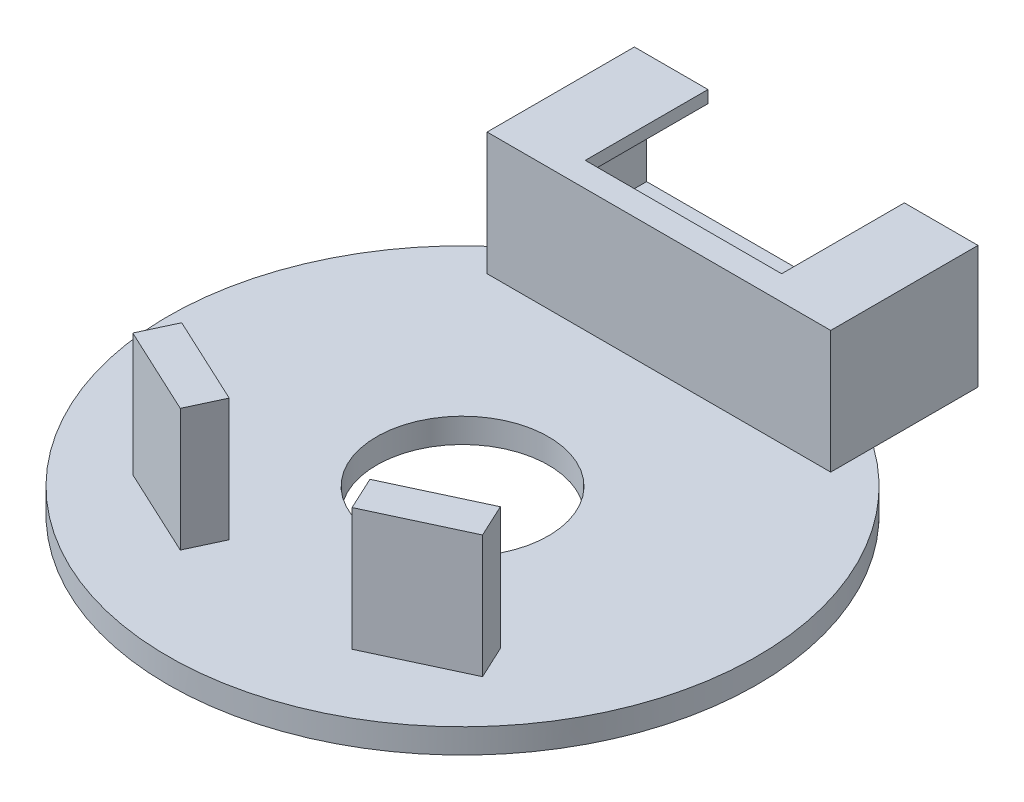
ISO-10303-21;
HEADER;
FILE_DESCRIPTION(('STEP AP214'),'2;1');
FILE_NAME('part.step','',(''),(''),'','','');
FILE_SCHEMA(('AUTOMOTIVE_DESIGN { 1 0 10303 214 1 1 1 1 }'));
ENDSEC;
DATA;
#1=APPLICATION_CONTEXT('core data for automotive mechanical design processes');
#2=APPLICATION_PROTOCOL_DEFINITION('international standard','automotive_design',2000,#1);
#3=PRODUCT_CONTEXT('',#1,'mechanical');
#4=PRODUCT('Part','Part','',(#3));
#5=PRODUCT_RELATED_PRODUCT_CATEGORY('part','',(#4));
#6=PRODUCT_DEFINITION_FORMATION('','',#4);
#7=PRODUCT_DEFINITION_CONTEXT('part definition',#1,'design');
#8=PRODUCT_DEFINITION('design','',#6,#7);
#9=PRODUCT_DEFINITION_SHAPE('','',#8);
#10=(LENGTH_UNIT() NAMED_UNIT(*) SI_UNIT(.MILLI.,.METRE.));
#11=(NAMED_UNIT(*) PLANE_ANGLE_UNIT() SI_UNIT($,.RADIAN.));
#12=(NAMED_UNIT(*) SI_UNIT($,.STERADIAN.) SOLID_ANGLE_UNIT());
#13=UNCERTAINTY_MEASURE_WITH_UNIT(LENGTH_MEASURE(1.E-05),#10,'distance_accuracy_value','');
#14=(GEOMETRIC_REPRESENTATION_CONTEXT(3) GLOBAL_UNCERTAINTY_ASSIGNED_CONTEXT((#13)) GLOBAL_UNIT_ASSIGNED_CONTEXT((#10,
#11,#12)) REPRESENTATION_CONTEXT('',''));
#15=CARTESIAN_POINT('',(0.,0.,0.));
#16=DIRECTION('',(0.,0.,1.));
#17=DIRECTION('',(1.,0.,0.));
#18=AXIS2_PLACEMENT_3D('',#15,#16,#17);
#19=CARTESIAN_POINT('',(0.,0.5,0.));
#20=DIRECTION('',(0.,1.,0.));
#21=DIRECTION('',(0.,0.,1.));
#22=AXIS2_PLACEMENT_3D('',#19,#20,#21);
#23=PLANE('',#22);
#24=DIRECTION('',(0.,0.,1.));
#25=VECTOR('',#24,1.);
#26=CARTESIAN_POINT('',(-7.,0.5,-14.));
#27=LINE('',#26,#25);
#28=CARTESIAN_POINT('',(-7.,0.5,-9.74679434480897));
#29=VERTEX_POINT('',#28);
#30=CARTESIAN_POINT('',(-7.,0.5,-8.));
#31=VERTEX_POINT('',#30);
#32=EDGE_CURVE('E12',#29,#31,#27,.T.);
#33=ORIENTED_EDGE('',*,*,#32,.F.);
#34=CARTESIAN_POINT('',(0.,0.5,0.));
#35=DIRECTION('',(0.,1.,0.));
#36=DIRECTION('',(0.,0.,1.));
#37=AXIS2_PLACEMENT_3D('',#34,#35,#36);
#38=CIRCLE('',#37,12.);
#39=CARTESIAN_POINT('',(7.,0.5,-9.74679434480897));
#40=VERTEX_POINT('',#39);
#41=EDGE_CURVE('E340',#29,#40,#38,.T.);
#42=ORIENTED_EDGE('',*,*,#41,.T.);
#43=DIRECTION('',(0.,0.,-1.));
#44=VECTOR('',#43,1.);
#45=CARTESIAN_POINT('',(7.,0.5,-14.));
#46=LINE('',#45,#44);
#47=CARTESIAN_POINT('',(7.,0.5,-8.));
#48=VERTEX_POINT('',#47);
#49=EDGE_CURVE('E319',#48,#40,#46,.T.);
#50=ORIENTED_EDGE('',*,*,#49,.F.);
#51=DIRECTION('',(1.,0.,0.));
#52=VECTOR('',#51,1.);
#53=CARTESIAN_POINT('',(-7.,0.5,-8.));
#54=LINE('',#53,#52);
#55=EDGE_CURVE('E315',#31,#48,#54,.T.);
#56=ORIENTED_EDGE('',*,*,#55,.F.);
#57=EDGE_LOOP('',(#33,#42,#50,#56));
#58=FACE_BOUND('',#57,.T.);
#59=CARTESIAN_POINT('',(0.,0.5,0.));
#60=DIRECTION('',(0.,1.,0.));
#61=DIRECTION('',(0.,0.,1.));
#62=AXIS2_PLACEMENT_3D('',#59,#60,#61);
#63=CIRCLE('',#62,3.5);
#64=CARTESIAN_POINT('',(0.,0.5,3.5));
#65=VERTEX_POINT('',#64);
#66=EDGE_CURVE('E335',#65,#65,#63,.T.);
#67=ORIENTED_EDGE('',*,*,#66,.F.);
#68=EDGE_LOOP('',(#67));
#69=FACE_BOUND('',#68,.T.);
#70=DIRECTION('',(0.906307787036653,0.,0.422618261740693));
#71=VECTOR('',#70,1.);
#72=CARTESIAN_POINT('',(-3.5,0.5,8.));
#73=LINE('',#72,#71);
#74=CARTESIAN_POINT('',(-7.12523114814661,0.5,6.30952695303723));
#75=VERTEX_POINT('',#74);
#76=CARTESIAN_POINT('',(-3.5,0.5,8.));
#77=VERTEX_POINT('',#76);
#78=EDGE_CURVE('E226',#75,#77,#73,.T.);
#79=ORIENTED_EDGE('',*,*,#78,.F.);
#80=DIRECTION('',(-0.422618261740693,0.,0.906307787036653));
#81=VECTOR('',#80,1.);
#82=CARTESIAN_POINT('',(-7.12523114814661,0.5,6.30952695303723));
#83=LINE('',#82,#81);
#84=CARTESIAN_POINT('',(-6.49130375553557,0.5,4.95006527248225));
#85=VERTEX_POINT('',#84);
#86=EDGE_CURVE('E205',#85,#75,#83,.T.);
#87=ORIENTED_EDGE('',*,*,#86,.F.);
#88=DIRECTION('',(-0.906307787036653,0.,-0.422618261740693));
#89=VECTOR('',#88,1.);
#90=CARTESIAN_POINT('',(-6.49130375553557,0.5,4.95006527248225));
#91=LINE('',#90,#89);
#92=CARTESIAN_POINT('',(-2.86607260738896,0.5,6.64053831944502));
#93=VERTEX_POINT('',#92);
#94=EDGE_CURVE('E219',#93,#85,#91,.T.);
#95=ORIENTED_EDGE('',*,*,#94,.F.);
#96=DIRECTION('',(0.422618261740693,0.,-0.906307787036653));
#97=VECTOR('',#96,1.);
#98=CARTESIAN_POINT('',(-2.86607260738896,0.5,6.64053831944502));
#99=LINE('',#98,#97);
#100=EDGE_CURVE('E63',#77,#93,#99,.T.);
#101=ORIENTED_EDGE('',*,*,#100,.F.);
#102=EDGE_LOOP('',(#79,#87,#95,#101));
#103=FACE_BOUND('',#102,.T.);
#104=DIRECTION('',(-0.422618261740693,0.,-0.906307787036653));
#105=VECTOR('',#104,1.);
#106=CARTESIAN_POINT('',(7.12523114814661,0.5,6.30952695303723));
#107=LINE('',#106,#105);
#108=CARTESIAN_POINT('',(7.12523114814661,0.5,6.30952695303723));
#109=VERTEX_POINT('',#108);
#110=CARTESIAN_POINT('',(6.49130375553557,0.5,4.95006527248225));
#111=VERTEX_POINT('',#110);
#112=EDGE_CURVE('E215',#109,#111,#107,.T.);
#113=ORIENTED_EDGE('',*,*,#112,.F.);
#114=DIRECTION('',(0.906307787036653,0.,-0.422618261740693));
#115=VECTOR('',#114,1.);
#116=CARTESIAN_POINT('',(3.5,0.5,8.));
#117=LINE('',#116,#115);
#118=CARTESIAN_POINT('',(3.5,0.5,8.));
#119=VERTEX_POINT('',#118);
#120=EDGE_CURVE('E209',#119,#109,#117,.T.);
#121=ORIENTED_EDGE('',*,*,#120,.F.);
#122=DIRECTION('',(0.422618261740693,0.,0.906307787036653));
#123=VECTOR('',#122,1.);
#124=CARTESIAN_POINT('',(2.86607260738896,0.5,6.64053831944502));
#125=LINE('',#124,#123);
#126=CARTESIAN_POINT('',(2.86607260738896,0.5,6.64053831944502));
#127=VERTEX_POINT('',#126);
#128=EDGE_CURVE('E189',#127,#119,#125,.T.);
#129=ORIENTED_EDGE('',*,*,#128,.F.);
#130=DIRECTION('',(-0.906307787036653,0.,0.422618261740693));
#131=VECTOR('',#130,1.);
#132=CARTESIAN_POINT('',(6.49130375553557,0.5,4.95006527248225));
#133=LINE('',#132,#131);
#134=EDGE_CURVE('E55',#111,#127,#133,.T.);
#135=ORIENTED_EDGE('',*,*,#134,.F.);
#136=EDGE_LOOP('',(#113,#121,#129,#135));
#137=FACE_BOUND('',#136,.T.);
#138=ADVANCED_FACE('F37',(#58,#69,#103,#137),#23,.T.);
#139=CARTESIAN_POINT('',(6.5,5.,5.60147050873545));
#140=DIRECTION('',(0.,1.,0.));
#141=DIRECTION('',(0.,0.,1.));
#142=AXIS2_PLACEMENT_3D('',#139,#140,#141);
#143=PLANE('',#142);
#144=DIRECTION('',(-1.,0.,0.));
#145=VECTOR('',#144,1.);
#146=CARTESIAN_POINT('',(6.5,5.,-9.));
#147=LINE('',#146,#145);
#148=CARTESIAN_POINT('',(6.5,5.,-9.));
#149=VERTEX_POINT('',#148);
#150=CARTESIAN_POINT('',(4.,5.,-9.));
#151=VERTEX_POINT('',#150);
#152=EDGE_CURVE('E274',#149,#151,#147,.T.);
#153=ORIENTED_EDGE('',*,*,#152,.T.);
#154=DIRECTION('',(0.,0.,-1.));
#155=VECTOR('',#154,1.);
#156=CARTESIAN_POINT('',(4.,5.,5.60147050873545));
#157=LINE('',#156,#155);
#158=CARTESIAN_POINT('',(4.,5.,-14.));
#159=VERTEX_POINT('',#158);
#160=EDGE_CURVE('E266',#151,#159,#157,.T.);
#161=ORIENTED_EDGE('',*,*,#160,.T.);
#162=DIRECTION('',(1.,0.,0.));
#163=VECTOR('',#162,1.);
#164=CARTESIAN_POINT('',(6.5,5.,-14.));
#165=LINE('',#164,#163);
#166=CARTESIAN_POINT('',(6.5,5.,-14.));
#167=VERTEX_POINT('',#166);
#168=EDGE_CURVE('E286',#159,#167,#165,.T.);
#169=ORIENTED_EDGE('',*,*,#168,.T.);
#170=DIRECTION('',(0.,0.,-1.));
#171=VECTOR('',#170,1.);
#172=CARTESIAN_POINT('',(6.5,5.,5.60147050873545));
#173=LINE('',#172,#171);
#174=EDGE_CURVE('E273',#149,#167,#173,.T.);
#175=ORIENTED_EDGE('',*,*,#174,.F.);
#176=EDGE_LOOP('',(#153,#161,#169,#175));
#177=FACE_BOUND('',#176,.T.);
#178=ADVANCED_FACE('F354',(#177),#143,.F.);
#179=CARTESIAN_POINT('',(0.,-0.5,0.));
#180=DIRECTION('',(0.,1.,0.));
#181=DIRECTION('',(0.,0.,1.));
#182=AXIS2_PLACEMENT_3D('',#179,#180,#181);
#183=PLANE('',#182);
#184=CARTESIAN_POINT('',(0.,-0.5,0.));
#185=DIRECTION('',(0.,1.,0.));
#186=DIRECTION('',(0.,0.,1.));
#187=AXIS2_PLACEMENT_3D('',#184,#185,#186);
#188=CIRCLE('',#187,12.);
#189=CARTESIAN_POINT('',(0.,-0.5,12.));
#190=VERTEX_POINT('',#189);
#191=EDGE_CURVE('E41',#190,#190,#188,.T.);
#192=ORIENTED_EDGE('',*,*,#191,.F.);
#193=EDGE_LOOP('',(#192));
#194=FACE_BOUND('',#193,.T.);
#195=CARTESIAN_POINT('',(0.,-0.5,0.));
#196=DIRECTION('',(0.,1.,0.));
#197=DIRECTION('',(0.,0.,1.));
#198=AXIS2_PLACEMENT_3D('',#195,#196,#197);
#199=CIRCLE('',#198,3.5);
#200=CARTESIAN_POINT('',(0.,-0.5,3.5));
#201=VERTEX_POINT('',#200);
#202=EDGE_CURVE('E334',#201,#201,#199,.T.);
#203=ORIENTED_EDGE('',*,*,#202,.T.);
#204=EDGE_LOOP('',(#203));
#205=FACE_BOUND('',#204,.T.);
#206=ADVANCED_FACE('F351',(#194,#205),#183,.F.);
#207=CARTESIAN_POINT('',(0.,0.5,0.));
#208=DIRECTION('',(0.,-1.,0.));
#209=DIRECTION('',(0.,0.,-1.));
#210=AXIS2_PLACEMENT_3D('',#207,#208,#209);
#211=CYLINDRICAL_SURFACE('',#210,12.);
#212=EDGE_CURVE('E46',#40,#29,#38,.T.);
#213=ORIENTED_EDGE('',*,*,#212,.F.);
#214=ORIENTED_EDGE('',*,*,#41,.F.);
#215=EDGE_LOOP('',(#213,#214));
#216=FACE_BOUND('',#215,.T.);
#217=ORIENTED_EDGE('',*,*,#191,.T.);
#218=EDGE_LOOP('',(#217));
#219=FACE_BOUND('',#218,.T.);
#220=ADVANCED_FACE('F39',(#216,#219),#211,.T.);
#221=CARTESIAN_POINT('',(0.,0.5,0.));
#222=DIRECTION('',(0.,-1.,0.));
#223=DIRECTION('',(0.,0.,-1.));
#224=AXIS2_PLACEMENT_3D('',#221,#222,#223);
#225=CYLINDRICAL_SURFACE('',#224,3.5);
#226=ORIENTED_EDGE('',*,*,#66,.T.);
#227=EDGE_LOOP('',(#226));
#228=FACE_BOUND('',#227,.T.);
#229=ORIENTED_EDGE('',*,*,#202,.F.);
#230=EDGE_LOOP('',(#229));
#231=FACE_BOUND('',#230,.T.);
#232=ADVANCED_FACE('F357',(#228,#231),#225,.F.);
#233=CARTESIAN_POINT('',(0.,0.5,0.));
#234=DIRECTION('',(0.,1.,0.));
#235=DIRECTION('',(0.,0.,1.));
#236=AXIS2_PLACEMENT_3D('',#233,#234,#235);
#237=PLANE('',#236);
#238=CARTESIAN_POINT('',(7.,0.5,-14.));
#239=VERTEX_POINT('',#238);
#240=EDGE_CURVE('E318',#40,#239,#46,.T.);
#241=ORIENTED_EDGE('',*,*,#240,.F.);
#242=ORIENTED_EDGE('',*,*,#212,.T.);
#243=CARTESIAN_POINT('',(-7.,0.5,-14.));
#244=VERTEX_POINT('',#243);
#245=EDGE_CURVE('E48',#244,#29,#27,.T.);
#246=ORIENTED_EDGE('',*,*,#245,.F.);
#247=DIRECTION('',(-1.,0.,0.));
#248=VECTOR('',#247,1.);
#249=CARTESIAN_POINT('',(-7.,0.5,-14.));
#250=LINE('',#249,#248);
#251=EDGE_CURVE('E305',#239,#244,#250,.T.);
#252=ORIENTED_EDGE('',*,*,#251,.F.);
#253=EDGE_LOOP('',(#241,#242,#246,#252));
#254=FACE_BOUND('',#253,.T.);
#255=ADVANCED_FACE('F359',(#254),#237,.F.);
#256=CARTESIAN_POINT('',(-7.,5.5,-14.));
#257=DIRECTION('',(1.,0.,0.));
#258=DIRECTION('',(0.,0.,-1.));
#259=AXIS2_PLACEMENT_3D('',#256,#257,#258);
#260=PLANE('',#259);
#261=ORIENTED_EDGE('',*,*,#245,.T.);
#262=ORIENTED_EDGE('',*,*,#32,.T.);
#263=DIRECTION('',(0.,-1.,0.));
#264=VECTOR('',#263,1.);
#265=CARTESIAN_POINT('',(-7.,5.5,-8.));
#266=LINE('',#265,#264);
#267=CARTESIAN_POINT('',(-7.,5.5,-8.));
#268=VERTEX_POINT('',#267);
#269=EDGE_CURVE('E331',#268,#31,#266,.T.);
#270=ORIENTED_EDGE('',*,*,#269,.F.);
#271=DIRECTION('',(0.,0.,1.));
#272=VECTOR('',#271,1.);
#273=CARTESIAN_POINT('',(-7.,5.5,-14.));
#274=LINE('',#273,#272);
#275=CARTESIAN_POINT('',(-7.,5.5,-14.));
#276=VERTEX_POINT('',#275);
#277=EDGE_CURVE('E301',#276,#268,#274,.T.);
#278=ORIENTED_EDGE('',*,*,#277,.F.);
#279=DIRECTION('',(0.,-1.,0.));
#280=VECTOR('',#279,1.);
#281=CARTESIAN_POINT('',(-7.,5.5,-14.));
#282=LINE('',#281,#280);
#283=EDGE_CURVE('E312',#276,#244,#282,.T.);
#284=ORIENTED_EDGE('',*,*,#283,.T.);
#285=EDGE_LOOP('',(#261,#262,#270,#278,#284));
#286=FACE_BOUND('',#285,.T.);
#287=ADVANCED_FACE('F366',(#286),#260,.F.);
#288=CARTESIAN_POINT('',(-7.,5.5,-8.));
#289=DIRECTION('',(0.,0.,-1.));
#290=DIRECTION('',(-1.,0.,0.));
#291=AXIS2_PLACEMENT_3D('',#288,#289,#290);
#292=PLANE('',#291);
#293=ORIENTED_EDGE('',*,*,#55,.T.);
#294=DIRECTION('',(0.,-1.,0.));
#295=VECTOR('',#294,1.);
#296=CARTESIAN_POINT('',(7.,5.5,-8.));
#297=LINE('',#296,#295);
#298=CARTESIAN_POINT('',(7.,5.5,-8.));
#299=VERTEX_POINT('',#298);
#300=EDGE_CURVE('E328',#299,#48,#297,.T.);
#301=ORIENTED_EDGE('',*,*,#300,.F.);
#302=DIRECTION('',(1.,0.,0.));
#303=VECTOR('',#302,1.);
#304=CARTESIAN_POINT('',(-7.,5.5,-8.));
#305=LINE('',#304,#303);
#306=EDGE_CURVE('E304',#268,#299,#305,.T.);
#307=ORIENTED_EDGE('',*,*,#306,.F.);
#308=ORIENTED_EDGE('',*,*,#269,.T.);
#309=EDGE_LOOP('',(#293,#301,#307,#308));
#310=FACE_BOUND('',#309,.T.);
#311=ADVANCED_FACE('F461',(#310),#292,.F.);
#312=CARTESIAN_POINT('',(7.,5.5,-14.));
#313=DIRECTION('',(-1.,0.,0.));
#314=DIRECTION('',(0.,0.,1.));
#315=AXIS2_PLACEMENT_3D('',#312,#313,#314);
#316=PLANE('',#315);
#317=ORIENTED_EDGE('',*,*,#49,.T.);
#318=ORIENTED_EDGE('',*,*,#240,.T.);
#319=DIRECTION('',(0.,-1.,0.));
#320=VECTOR('',#319,1.);
#321=CARTESIAN_POINT('',(7.,5.5,-14.));
#322=LINE('',#321,#320);
#323=CARTESIAN_POINT('',(7.,5.5,-14.));
#324=VERTEX_POINT('',#323);
#325=EDGE_CURVE('E325',#324,#239,#322,.T.);
#326=ORIENTED_EDGE('',*,*,#325,.F.);
#327=DIRECTION('',(0.,0.,-1.));
#328=VECTOR('',#327,1.);
#329=CARTESIAN_POINT('',(7.,5.5,-14.));
#330=LINE('',#329,#328);
#331=EDGE_CURVE('E307',#299,#324,#330,.T.);
#332=ORIENTED_EDGE('',*,*,#331,.F.);
#333=ORIENTED_EDGE('',*,*,#300,.T.);
#334=EDGE_LOOP('',(#317,#318,#326,#332,#333));
#335=FACE_BOUND('',#334,.T.);
#336=ADVANCED_FACE('F457',(#335),#316,.F.);
#337=CARTESIAN_POINT('',(-7.,5.5,-14.));
#338=DIRECTION('',(0.,0.,1.));
#339=DIRECTION('',(1.,0.,0.));
#340=AXIS2_PLACEMENT_3D('',#337,#338,#339);
#341=PLANE('',#340);
#342=ORIENTED_EDGE('',*,*,#168,.F.);
#343=DIRECTION('',(0.,1.,0.));
#344=VECTOR('',#343,1.);
#345=CARTESIAN_POINT('',(4.,-8.4339811320566,-14.));
#346=LINE('',#345,#344);
#347=CARTESIAN_POINT('',(4.,5.5,-14.));
#348=VERTEX_POINT('',#347);
#349=EDGE_CURVE('E258',#159,#348,#346,.T.);
#350=ORIENTED_EDGE('',*,*,#349,.T.);
#351=DIRECTION('',(-1.,0.,0.));
#352=VECTOR('',#351,1.);
#353=CARTESIAN_POINT('',(-7.,5.5,-14.));
#354=LINE('',#353,#352);
#355=EDGE_CURVE('E310',#324,#348,#354,.T.);
#356=ORIENTED_EDGE('',*,*,#355,.F.);
#357=ORIENTED_EDGE('',*,*,#325,.T.);
#358=ORIENTED_EDGE('',*,*,#251,.T.);
#359=ORIENTED_EDGE('',*,*,#283,.F.);
#360=CARTESIAN_POINT('',(-4.,5.5,-14.));
#361=VERTEX_POINT('',#360);
#362=EDGE_CURVE('E309',#361,#276,#354,.T.);
#363=ORIENTED_EDGE('',*,*,#362,.F.);
#364=DIRECTION('',(0.,1.,0.));
#365=VECTOR('',#364,1.);
#366=CARTESIAN_POINT('',(-4.,-8.4339811320566,-14.));
#367=LINE('',#366,#365);
#368=CARTESIAN_POINT('',(-4.,5.,-14.));
#369=VERTEX_POINT('',#368);
#370=EDGE_CURVE('E255',#369,#361,#367,.T.);
#371=ORIENTED_EDGE('',*,*,#370,.F.);
#372=CARTESIAN_POINT('',(-6.5,5.,-14.));
#373=VERTEX_POINT('',#372);
#374=EDGE_CURVE('E287',#373,#369,#165,.T.);
#375=ORIENTED_EDGE('',*,*,#374,.F.);
#376=DIRECTION('',(0.,1.,0.));
#377=VECTOR('',#376,1.);
#378=CARTESIAN_POINT('',(-6.5,5.,-14.));
#379=LINE('',#378,#377);
#380=CARTESIAN_POINT('',(-6.5,1.,-14.));
#381=VERTEX_POINT('',#380);
#382=EDGE_CURVE('E283',#381,#373,#379,.T.);
#383=ORIENTED_EDGE('',*,*,#382,.F.);
#384=DIRECTION('',(-1.,0.,0.));
#385=VECTOR('',#384,1.);
#386=CARTESIAN_POINT('',(6.5,1.,-14.));
#387=LINE('',#386,#385);
#388=CARTESIAN_POINT('',(6.5,1.,-14.));
#389=VERTEX_POINT('',#388);
#390=EDGE_CURVE('E281',#389,#381,#387,.T.);
#391=ORIENTED_EDGE('',*,*,#390,.F.);
#392=DIRECTION('',(0.,-1.,0.));
#393=VECTOR('',#392,1.);
#394=CARTESIAN_POINT('',(6.5,5.,-14.));
#395=LINE('',#394,#393);
#396=EDGE_CURVE('E269',#167,#389,#395,.T.);
#397=ORIENTED_EDGE('',*,*,#396,.F.);
#398=EDGE_LOOP('',(#342,#350,#356,#357,#358,#359,#363,#371,#375,#383,#391,#397));
#399=FACE_BOUND('',#398,.T.);
#400=ADVANCED_FACE('F452',(#399),#341,.F.);
#401=CARTESIAN_POINT('',(0.,5.5,0.));
#402=DIRECTION('',(0.,1.,0.));
#403=DIRECTION('',(0.,0.,1.));
#404=AXIS2_PLACEMENT_3D('',#401,#402,#403);
#405=PLANE('',#404);
#406=DIRECTION('',(0.,0.,-1.));
#407=VECTOR('',#406,1.);
#408=CARTESIAN_POINT('',(4.,5.5,-14.));
#409=LINE('',#408,#407);
#410=CARTESIAN_POINT('',(4.,5.5,-9.));
#411=VERTEX_POINT('',#410);
#412=EDGE_CURVE('E247',#411,#348,#409,.T.);
#413=ORIENTED_EDGE('',*,*,#412,.F.);
#414=DIRECTION('',(1.,0.,0.));
#415=VECTOR('',#414,1.);
#416=CARTESIAN_POINT('',(-4.,5.5,-9.));
#417=LINE('',#416,#415);
#418=CARTESIAN_POINT('',(-4.,5.5,-9.));
#419=VERTEX_POINT('',#418);
#420=EDGE_CURVE('E250',#419,#411,#417,.T.);
#421=ORIENTED_EDGE('',*,*,#420,.F.);
#422=DIRECTION('',(0.,0.,1.));
#423=VECTOR('',#422,1.);
#424=CARTESIAN_POINT('',(-4.,5.5,-14.));
#425=LINE('',#424,#423);
#426=EDGE_CURVE('E235',#361,#419,#425,.T.);
#427=ORIENTED_EDGE('',*,*,#426,.F.);
#428=ORIENTED_EDGE('',*,*,#362,.T.);
#429=ORIENTED_EDGE('',*,*,#277,.T.);
#430=ORIENTED_EDGE('',*,*,#306,.T.);
#431=ORIENTED_EDGE('',*,*,#331,.T.);
#432=ORIENTED_EDGE('',*,*,#355,.T.);
#433=EDGE_LOOP('',(#413,#421,#427,#428,#429,#430,#431,#432));
#434=FACE_BOUND('',#433,.T.);
#435=ADVANCED_FACE('F449',(#434),#405,.T.);
#436=CARTESIAN_POINT('',(6.5,5.,5.60147050873545));
#437=DIRECTION('',(1.,0.,0.));
#438=DIRECTION('',(0.,1.,0.));
#439=AXIS2_PLACEMENT_3D('',#436,#437,#438);
#440=PLANE('',#439);
#441=DIRECTION('',(0.,1.,0.));
#442=VECTOR('',#441,1.);
#443=CARTESIAN_POINT('',(6.5,5.,-9.));
#444=LINE('',#443,#442);
#445=CARTESIAN_POINT('',(6.5,1.,-9.));
#446=VERTEX_POINT('',#445);
#447=EDGE_CURVE('E277',#446,#149,#444,.T.);
#448=ORIENTED_EDGE('',*,*,#447,.T.);
#449=ORIENTED_EDGE('',*,*,#174,.T.);
#450=ORIENTED_EDGE('',*,*,#396,.T.);
#451=DIRECTION('',(0.,0.,-1.));
#452=VECTOR('',#451,1.);
#453=CARTESIAN_POINT('',(6.5,1.,5.60147050873545));
#454=LINE('',#453,#452);
#455=EDGE_CURVE('E290',#446,#389,#454,.T.);
#456=ORIENTED_EDGE('',*,*,#455,.F.);
#457=EDGE_LOOP('',(#448,#449,#450,#456));
#458=FACE_BOUND('',#457,.T.);
#459=ADVANCED_FACE('F439',(#458),#440,.F.);
#460=ORIENTED_EDGE('',*,*,#374,.T.);
#461=DIRECTION('',(0.,0.,1.));
#462=VECTOR('',#461,1.);
#463=CARTESIAN_POINT('',(-4.,5.,5.60147050873545));
#464=LINE('',#463,#462);
#465=CARTESIAN_POINT('',(-4.,5.,-9.));
#466=VERTEX_POINT('',#465);
#467=EDGE_CURVE('E263',#369,#466,#464,.T.);
#468=ORIENTED_EDGE('',*,*,#467,.T.);
#469=CARTESIAN_POINT('',(-6.5,5.,-9.));
#470=VERTEX_POINT('',#469);
#471=EDGE_CURVE('E272',#466,#470,#147,.T.);
#472=ORIENTED_EDGE('',*,*,#471,.T.);
#473=DIRECTION('',(0.,0.,-1.));
#474=VECTOR('',#473,1.);
#475=CARTESIAN_POINT('',(-6.5,5.,5.60147050873545));
#476=LINE('',#475,#474);
#477=EDGE_CURVE('E293',#470,#373,#476,.T.);
#478=ORIENTED_EDGE('',*,*,#477,.T.);
#479=EDGE_LOOP('',(#460,#468,#472,#478));
#480=FACE_BOUND('',#479,.T.);
#481=ADVANCED_FACE('F377',(#480),#143,.F.);
#482=CARTESIAN_POINT('',(-6.5,5.,5.60147050873545));
#483=DIRECTION('',(-1.,0.,0.));
#484=DIRECTION('',(0.,-1.,0.));
#485=AXIS2_PLACEMENT_3D('',#482,#483,#484);
#486=PLANE('',#485);
#487=DIRECTION('',(0.,-1.,0.));
#488=VECTOR('',#487,1.);
#489=CARTESIAN_POINT('',(-6.5,5.,-9.));
#490=LINE('',#489,#488);
#491=CARTESIAN_POINT('',(-6.5,1.,-9.));
#492=VERTEX_POINT('',#491);
#493=EDGE_CURVE('E270',#470,#492,#490,.T.);
#494=ORIENTED_EDGE('',*,*,#493,.T.);
#495=DIRECTION('',(0.,0.,-1.));
#496=VECTOR('',#495,1.);
#497=CARTESIAN_POINT('',(-6.5,1.,5.60147050873545));
#498=LINE('',#497,#496);
#499=EDGE_CURVE('E295',#492,#381,#498,.T.);
#500=ORIENTED_EDGE('',*,*,#499,.T.);
#501=ORIENTED_EDGE('',*,*,#382,.T.);
#502=ORIENTED_EDGE('',*,*,#477,.F.);
#503=EDGE_LOOP('',(#494,#500,#501,#502));
#504=FACE_BOUND('',#503,.T.);
#505=ADVANCED_FACE('F438',(#504),#486,.F.);
#506=CARTESIAN_POINT('',(6.5,1.,5.60147050873545));
#507=DIRECTION('',(0.,-1.,0.));
#508=DIRECTION('',(0.,0.,-1.));
#509=AXIS2_PLACEMENT_3D('',#506,#507,#508);
#510=PLANE('',#509);
#511=DIRECTION('',(1.,0.,0.));
#512=VECTOR('',#511,1.);
#513=CARTESIAN_POINT('',(6.5,1.,-9.));
#514=LINE('',#513,#512);
#515=EDGE_CURVE('E279',#492,#446,#514,.T.);
#516=ORIENTED_EDGE('',*,*,#515,.T.);
#517=ORIENTED_EDGE('',*,*,#455,.T.);
#518=ORIENTED_EDGE('',*,*,#390,.T.);
#519=ORIENTED_EDGE('',*,*,#499,.F.);
#520=EDGE_LOOP('',(#516,#517,#518,#519));
#521=FACE_BOUND('',#520,.T.);
#522=ADVANCED_FACE('F434',(#521),#510,.F.);
#523=CARTESIAN_POINT('',(-7.,5.5,-9.));
#524=DIRECTION('',(0.,0.,-1.));
#525=DIRECTION('',(-1.,0.,0.));
#526=AXIS2_PLACEMENT_3D('',#523,#524,#525);
#527=PLANE('',#526);
#528=ORIENTED_EDGE('',*,*,#471,.F.);
#529=DIRECTION('',(0.,1.,0.));
#530=VECTOR('',#529,1.);
#531=CARTESIAN_POINT('',(-4.,-8.4339811320566,-9.));
#532=LINE('',#531,#530);
#533=EDGE_CURVE('E257',#466,#419,#532,.T.);
#534=ORIENTED_EDGE('',*,*,#533,.T.);
#535=ORIENTED_EDGE('',*,*,#420,.T.);
#536=DIRECTION('',(0.,1.,0.));
#537=VECTOR('',#536,1.);
#538=CARTESIAN_POINT('',(4.,-8.4339811320566,-9.));
#539=LINE('',#538,#537);
#540=EDGE_CURVE('E249',#151,#411,#539,.T.);
#541=ORIENTED_EDGE('',*,*,#540,.F.);
#542=ORIENTED_EDGE('',*,*,#152,.F.);
#543=ORIENTED_EDGE('',*,*,#447,.F.);
#544=ORIENTED_EDGE('',*,*,#515,.F.);
#545=ORIENTED_EDGE('',*,*,#493,.F.);
#546=EDGE_LOOP('',(#528,#534,#535,#541,#542,#543,#544,#545));
#547=FACE_BOUND('',#546,.T.);
#548=ADVANCED_FACE('F431',(#547),#527,.T.);
#549=CARTESIAN_POINT('',(4.,-8.4339811320566,-14.));
#550=DIRECTION('',(1.,0.,0.));
#551=DIRECTION('',(0.,0.,-1.));
#552=AXIS2_PLACEMENT_3D('',#549,#550,#551);
#553=PLANE('',#552);
#554=ORIENTED_EDGE('',*,*,#540,.T.);
#555=ORIENTED_EDGE('',*,*,#412,.T.);
#556=ORIENTED_EDGE('',*,*,#349,.F.);
#557=ORIENTED_EDGE('',*,*,#160,.F.);
#558=EDGE_LOOP('',(#554,#555,#556,#557));
#559=FACE_BOUND('',#558,.T.);
#560=ADVANCED_FACE('F427',(#559),#553,.F.);
#561=CARTESIAN_POINT('',(-4.,-8.4339811320566,-14.));
#562=DIRECTION('',(-1.,0.,0.));
#563=DIRECTION('',(0.,0.,1.));
#564=AXIS2_PLACEMENT_3D('',#561,#562,#563);
#565=PLANE('',#564);
#566=ORIENTED_EDGE('',*,*,#370,.T.);
#567=ORIENTED_EDGE('',*,*,#426,.T.);
#568=ORIENTED_EDGE('',*,*,#533,.F.);
#569=ORIENTED_EDGE('',*,*,#467,.F.);
#570=EDGE_LOOP('',(#566,#567,#568,#569));
#571=FACE_BOUND('',#570,.T.);
#572=ADVANCED_FACE('F422',(#571),#565,.F.);
#573=CARTESIAN_POINT('',(-7.12523114814661,10.7385621421749,6.30952695303723));
#574=DIRECTION('',(0.906307787036653,0.,0.422618261740693));
#575=DIRECTION('',(0.422618261740693,0.,-0.906307787036653));
#576=AXIS2_PLACEMENT_3D('',#573,#574,#575);
#577=PLANE('',#576);
#578=DIRECTION('',(-0.422618261740693,0.,0.906307787036653));
#579=VECTOR('',#578,1.);
#580=CARTESIAN_POINT('',(-7.12523114814661,5.5,6.30952695303723));
#581=LINE('',#580,#579);
#582=CARTESIAN_POINT('',(-6.49130375553557,5.5,4.95006527248225));
#583=VERTEX_POINT('',#582);
#584=CARTESIAN_POINT('',(-7.12523114814661,5.5,6.30952695303723));
#585=VERTEX_POINT('',#584);
#586=EDGE_CURVE('E239',#583,#585,#581,.T.);
#587=ORIENTED_EDGE('',*,*,#586,.F.);
#588=DIRECTION('',(0.,-1.,0.));
#589=VECTOR('',#588,1.);
#590=CARTESIAN_POINT('',(-6.49130375553557,10.7385621421749,4.95006527248225));
#591=LINE('',#590,#589);
#592=EDGE_CURVE('E203',#583,#85,#591,.T.);
#593=ORIENTED_EDGE('',*,*,#592,.T.);
#594=ORIENTED_EDGE('',*,*,#86,.T.);
#595=DIRECTION('',(0.,-1.,0.));
#596=VECTOR('',#595,1.);
#597=CARTESIAN_POINT('',(-7.12523114814661,10.7385621421749,6.30952695303723));
#598=LINE('',#597,#596);
#599=EDGE_CURVE('E229',#585,#75,#598,.T.);
#600=ORIENTED_EDGE('',*,*,#599,.F.);
#601=EDGE_LOOP('',(#587,#593,#594,#600));
#602=FACE_BOUND('',#601,.T.);
#603=ADVANCED_FACE('F419',(#602),#577,.F.);
#604=CARTESIAN_POINT('',(-3.5,10.7385621421749,8.));
#605=DIRECTION('',(0.422618261740693,0.,-0.906307787036653));
#606=DIRECTION('',(-0.906307787036653,0.,-0.422618261740694));
#607=AXIS2_PLACEMENT_3D('',#604,#605,#606);
#608=PLANE('',#607);
#609=DIRECTION('',(0.906307787036653,0.,0.422618261740694));
#610=VECTOR('',#609,1.);
#611=CARTESIAN_POINT('',(-3.5,5.5,8.));
#612=LINE('',#611,#610);
#613=CARTESIAN_POINT('',(-3.5,5.5,8.));
#614=VERTEX_POINT('',#613);
#615=EDGE_CURVE('E236',#585,#614,#612,.T.);
#616=ORIENTED_EDGE('',*,*,#615,.F.);
#617=ORIENTED_EDGE('',*,*,#599,.T.);
#618=ORIENTED_EDGE('',*,*,#78,.T.);
#619=DIRECTION('',(0.,-1.,0.));
#620=VECTOR('',#619,1.);
#621=CARTESIAN_POINT('',(-3.5,10.7385621421749,8.));
#622=LINE('',#621,#620);
#623=EDGE_CURVE('E225',#614,#77,#622,.T.);
#624=ORIENTED_EDGE('',*,*,#623,.F.);
#625=EDGE_LOOP('',(#616,#617,#618,#624));
#626=FACE_BOUND('',#625,.T.);
#627=ADVANCED_FACE('F416',(#626),#608,.F.);
#628=CARTESIAN_POINT('',(-2.86607260738896,10.7385621421749,6.64053831944502));
#629=DIRECTION('',(-0.906307787036653,0.,-0.422618261740693));
#630=DIRECTION('',(-0.422618261740694,0.,0.906307787036653));
#631=AXIS2_PLACEMENT_3D('',#628,#629,#630);
#632=PLANE('',#631);
#633=DIRECTION('',(0.422618261740694,0.,-0.906307787036653));
#634=VECTOR('',#633,1.);
#635=CARTESIAN_POINT('',(-2.86607260738896,5.5,6.64053831944502));
#636=LINE('',#635,#634);
#637=CARTESIAN_POINT('',(-2.86607260738896,5.5,6.64053831944502));
#638=VERTEX_POINT('',#637);
#639=EDGE_CURVE('E232',#614,#638,#636,.T.);
#640=ORIENTED_EDGE('',*,*,#639,.F.);
#641=ORIENTED_EDGE('',*,*,#623,.T.);
#642=ORIENTED_EDGE('',*,*,#100,.T.);
#643=DIRECTION('',(0.,-1.,0.));
#644=VECTOR('',#643,1.);
#645=CARTESIAN_POINT('',(-2.86607260738896,10.7385621421749,6.64053831944502));
#646=LINE('',#645,#644);
#647=EDGE_CURVE('E223',#638,#93,#646,.T.);
#648=ORIENTED_EDGE('',*,*,#647,.F.);
#649=EDGE_LOOP('',(#640,#641,#642,#648));
#650=FACE_BOUND('',#649,.T.);
#651=ADVANCED_FACE('F412',(#650),#632,.F.);
#652=CARTESIAN_POINT('',(-6.49130375553557,10.7385621421749,4.95006527248225));
#653=DIRECTION('',(-0.422618261740693,0.,0.906307787036653));
#654=DIRECTION('',(0.906307787036653,0.,0.422618261740693));
#655=AXIS2_PLACEMENT_3D('',#652,#653,#654);
#656=PLANE('',#655);
#657=DIRECTION('',(-0.906307787036653,0.,-0.422618261740693));
#658=VECTOR('',#657,1.);
#659=CARTESIAN_POINT('',(-6.49130375553557,5.5,4.95006527248225));
#660=LINE('',#659,#658);
#661=EDGE_CURVE('E222',#638,#583,#660,.T.);
#662=ORIENTED_EDGE('',*,*,#661,.F.);
#663=ORIENTED_EDGE('',*,*,#647,.T.);
#664=ORIENTED_EDGE('',*,*,#94,.T.);
#665=ORIENTED_EDGE('',*,*,#592,.F.);
#666=EDGE_LOOP('',(#662,#663,#664,#665));
#667=FACE_BOUND('',#666,.T.);
#668=ADVANCED_FACE('F403',(#667),#656,.F.);
#669=CARTESIAN_POINT('',(0.,5.5,0.));
#670=DIRECTION('',(0.,1.,0.));
#671=DIRECTION('',(0.,0.,1.));
#672=AXIS2_PLACEMENT_3D('',#669,#670,#671);
#673=PLANE('',#672);
#674=ORIENTED_EDGE('',*,*,#661,.T.);
#675=ORIENTED_EDGE('',*,*,#586,.T.);
#676=ORIENTED_EDGE('',*,*,#615,.T.);
#677=ORIENTED_EDGE('',*,*,#639,.T.);
#678=EDGE_LOOP('',(#674,#675,#676,#677));
#679=FACE_BOUND('',#678,.T.);
#680=ADVANCED_FACE('F396',(#679),#673,.T.);
#681=CARTESIAN_POINT('',(3.5,10.7385621421749,8.));
#682=DIRECTION('',(-0.422618261740693,0.,-0.906307787036653));
#683=DIRECTION('',(-0.906307787036653,0.,0.422618261740694));
#684=AXIS2_PLACEMENT_3D('',#681,#682,#683);
#685=PLANE('',#684);
#686=DIRECTION('',(0.906307787036653,0.,-0.422618261740694));
#687=VECTOR('',#686,1.);
#688=CARTESIAN_POINT('',(3.5,5.5,8.));
#689=LINE('',#688,#687);
#690=CARTESIAN_POINT('',(3.5,5.5,8.));
#691=VERTEX_POINT('',#690);
#692=CARTESIAN_POINT('',(7.12523114814661,5.5,6.30952695303723));
#693=VERTEX_POINT('',#692);
#694=EDGE_CURVE('E198',#691,#693,#689,.T.);
#695=ORIENTED_EDGE('',*,*,#694,.F.);
#696=DIRECTION('',(0.,-1.,0.));
#697=VECTOR('',#696,1.);
#698=CARTESIAN_POINT('',(3.5,10.7385621421749,8.));
#699=LINE('',#698,#697);
#700=EDGE_CURVE('E194',#691,#119,#699,.T.);
#701=ORIENTED_EDGE('',*,*,#700,.T.);
#702=ORIENTED_EDGE('',*,*,#120,.T.);
#703=DIRECTION('',(0.,-1.,0.));
#704=VECTOR('',#703,1.);
#705=CARTESIAN_POINT('',(7.12523114814661,10.7385621421749,6.30952695303723));
#706=LINE('',#705,#704);
#707=EDGE_CURVE('E213',#693,#109,#706,.T.);
#708=ORIENTED_EDGE('',*,*,#707,.F.);
#709=EDGE_LOOP('',(#695,#701,#702,#708));
#710=FACE_BOUND('',#709,.T.);
#711=ADVANCED_FACE('F394',(#710),#685,.F.);
#712=CARTESIAN_POINT('',(7.12523114814661,10.7385621421749,6.30952695303723));
#713=DIRECTION('',(-0.906307787036653,0.,0.422618261740693));
#714=DIRECTION('',(0.422618261740693,0.,0.906307787036653));
#715=AXIS2_PLACEMENT_3D('',#712,#713,#714);
#716=PLANE('',#715);
#717=DIRECTION('',(-0.422618261740693,0.,-0.906307787036653));
#718=VECTOR('',#717,1.);
#719=CARTESIAN_POINT('',(7.12523114814661,5.5,6.30952695303723));
#720=LINE('',#719,#718);
#721=CARTESIAN_POINT('',(6.49130375553557,5.5,4.95006527248225));
#722=VERTEX_POINT('',#721);
#723=EDGE_CURVE('E202',#693,#722,#720,.T.);
#724=ORIENTED_EDGE('',*,*,#723,.F.);
#725=ORIENTED_EDGE('',*,*,#707,.T.);
#726=ORIENTED_EDGE('',*,*,#112,.T.);
#727=DIRECTION('',(0.,-1.,0.));
#728=VECTOR('',#727,1.);
#729=CARTESIAN_POINT('',(6.49130375553557,10.7385621421749,4.95006527248225));
#730=LINE('',#729,#728);
#731=EDGE_CURVE('E216',#722,#111,#730,.T.);
#732=ORIENTED_EDGE('',*,*,#731,.F.);
#733=EDGE_LOOP('',(#724,#725,#726,#732));
#734=FACE_BOUND('',#733,.T.);
#735=ADVANCED_FACE('F391',(#734),#716,.F.);
#736=CARTESIAN_POINT('',(6.49130375553557,10.7385621421749,4.95006527248225));
#737=DIRECTION('',(0.422618261740693,0.,0.906307787036653));
#738=DIRECTION('',(0.906307787036653,0.,-0.422618261740693));
#739=AXIS2_PLACEMENT_3D('',#736,#737,#738);
#740=PLANE('',#739);
#741=DIRECTION('',(-0.906307787036653,0.,0.422618261740693));
#742=VECTOR('',#741,1.);
#743=CARTESIAN_POINT('',(6.49130375553557,5.5,4.95006527248225));
#744=LINE('',#743,#742);
#745=CARTESIAN_POINT('',(2.86607260738896,5.5,6.64053831944502));
#746=VERTEX_POINT('',#745);
#747=EDGE_CURVE('E184',#722,#746,#744,.T.);
#748=ORIENTED_EDGE('',*,*,#747,.F.);
#749=ORIENTED_EDGE('',*,*,#731,.T.);
#750=ORIENTED_EDGE('',*,*,#134,.T.);
#751=DIRECTION('',(0.,-1.,0.));
#752=VECTOR('',#751,1.);
#753=CARTESIAN_POINT('',(2.86607260738896,10.7385621421749,6.64053831944502));
#754=LINE('',#753,#752);
#755=EDGE_CURVE('E180',#746,#127,#754,.T.);
#756=ORIENTED_EDGE('',*,*,#755,.F.);
#757=EDGE_LOOP('',(#748,#749,#750,#756));
#758=FACE_BOUND('',#757,.T.);
#759=ADVANCED_FACE('F182',(#758),#740,.F.);
#760=CARTESIAN_POINT('',(2.86607260738896,10.7385621421749,6.64053831944502));
#761=DIRECTION('',(0.906307787036653,0.,-0.422618261740693));
#762=DIRECTION('',(-0.422618261740694,0.,-0.906307787036653));
#763=AXIS2_PLACEMENT_3D('',#760,#761,#762);
#764=PLANE('',#763);
#765=DIRECTION('',(0.422618261740694,0.,0.906307787036653));
#766=VECTOR('',#765,1.);
#767=CARTESIAN_POINT('',(2.86607260738896,5.5,6.64053831944502));
#768=LINE('',#767,#766);
#769=EDGE_CURVE('E192',#746,#691,#768,.T.);
#770=ORIENTED_EDGE('',*,*,#769,.F.);
#771=ORIENTED_EDGE('',*,*,#755,.T.);
#772=ORIENTED_EDGE('',*,*,#128,.T.);
#773=ORIENTED_EDGE('',*,*,#700,.F.);
#774=EDGE_LOOP('',(#770,#771,#772,#773));
#775=FACE_BOUND('',#774,.T.);
#776=ADVANCED_FACE('F193',(#775),#764,.F.);
#777=CARTESIAN_POINT('',(0.,5.5,0.));
#778=DIRECTION('',(0.,1.,0.));
#779=DIRECTION('',(0.,0.,1.));
#780=AXIS2_PLACEMENT_3D('',#777,#778,#779);
#781=PLANE('',#780);
#782=ORIENTED_EDGE('',*,*,#769,.T.);
#783=ORIENTED_EDGE('',*,*,#694,.T.);
#784=ORIENTED_EDGE('',*,*,#723,.T.);
#785=ORIENTED_EDGE('',*,*,#747,.T.);
#786=EDGE_LOOP('',(#782,#783,#784,#785));
#787=FACE_BOUND('',#786,.T.);
#788=ADVANCED_FACE('F201',(#787),#781,.T.);
#789=CLOSED_SHELL('',(#138,#178,#206,#220,#232,#255,#287,#311,#336,#400,#435,#459,#481,#505,
#522,#548,#560,#572,#603,#627,#651,#668,#680,#711,#735,#759,#776,#788));
#790=MANIFOLD_SOLID_BREP('B2',#789);
#791=ADVANCED_BREP_SHAPE_REPRESENTATION('',(#18,#790),#14);
#792=SHAPE_DEFINITION_REPRESENTATION(#9,#791);
ENDSEC;
END-ISO-10303-21;
